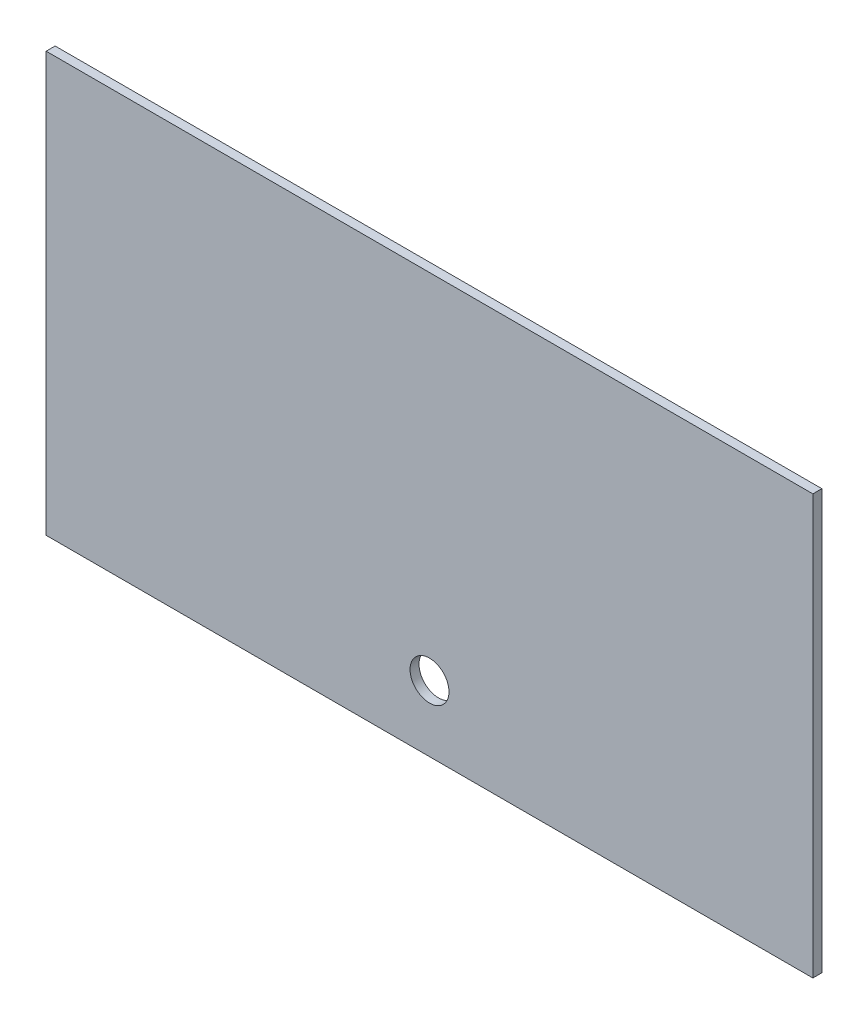
ISO-10303-21;
HEADER;
FILE_DESCRIPTION(('STEP AP214'),'2;1');
FILE_NAME('part.step','',(''),(''),'','','');
FILE_SCHEMA(('AUTOMOTIVE_DESIGN { 1 0 10303 214 1 1 1 1 }'));
ENDSEC;
DATA;
#1=APPLICATION_CONTEXT('core data for automotive mechanical design processes');
#2=APPLICATION_PROTOCOL_DEFINITION('international standard','automotive_design',2000,#1);
#3=PRODUCT_CONTEXT('',#1,'mechanical');
#4=PRODUCT('Part','Part','',(#3));
#5=PRODUCT_RELATED_PRODUCT_CATEGORY('part','',(#4));
#6=PRODUCT_DEFINITION_FORMATION('','',#4);
#7=PRODUCT_DEFINITION_CONTEXT('part definition',#1,'design');
#8=PRODUCT_DEFINITION('design','',#6,#7);
#9=PRODUCT_DEFINITION_SHAPE('','',#8);
#10=(LENGTH_UNIT() NAMED_UNIT(*) SI_UNIT(.MILLI.,.METRE.));
#11=(NAMED_UNIT(*) PLANE_ANGLE_UNIT() SI_UNIT($,.RADIAN.));
#12=(NAMED_UNIT(*) SI_UNIT($,.STERADIAN.) SOLID_ANGLE_UNIT());
#13=UNCERTAINTY_MEASURE_WITH_UNIT(LENGTH_MEASURE(1.E-05),#10,'distance_accuracy_value','');
#14=(GEOMETRIC_REPRESENTATION_CONTEXT(3) GLOBAL_UNCERTAINTY_ASSIGNED_CONTEXT((#13)) GLOBAL_UNIT_ASSIGNED_CONTEXT((#10,
#11,#12)) REPRESENTATION_CONTEXT('',''));
#15=CARTESIAN_POINT('',(0.,0.,0.));
#16=DIRECTION('',(0.,0.,1.));
#17=DIRECTION('',(1.,0.,0.));
#18=AXIS2_PLACEMENT_3D('',#15,#16,#17);
#19=CARTESIAN_POINT('',(64.,-35.,1.5));
#20=DIRECTION('',(-1.,0.,0.));
#21=DIRECTION('',(0.,0.,1.));
#22=AXIS2_PLACEMENT_3D('',#19,#20,#21);
#23=PLANE('',#22);
#24=DIRECTION('',(0.,1.,0.));
#25=VECTOR('',#24,1.);
#26=CARTESIAN_POINT('',(64.,-35.,0.));
#27=LINE('',#26,#25);
#28=CARTESIAN_POINT('',(64.,-35.,0.));
#29=VERTEX_POINT('',#28);
#30=CARTESIAN_POINT('',(64.,35.,0.));
#31=VERTEX_POINT('',#30);
#32=EDGE_CURVE('E107',#29,#31,#27,.T.);
#33=ORIENTED_EDGE('',*,*,#32,.T.);
#34=DIRECTION('',(0.,0.,-1.));
#35=VECTOR('',#34,1.);
#36=CARTESIAN_POINT('',(64.,35.,1.5));
#37=LINE('',#36,#35);
#38=CARTESIAN_POINT('',(64.,35.,1.5));
#39=VERTEX_POINT('',#38);
#40=EDGE_CURVE('E11',#39,#31,#37,.T.);
#41=ORIENTED_EDGE('',*,*,#40,.F.);
#42=DIRECTION('',(0.,1.,0.));
#43=VECTOR('',#42,1.);
#44=CARTESIAN_POINT('',(64.,-35.,1.5));
#45=LINE('',#44,#43);
#46=CARTESIAN_POINT('',(64.,-35.,1.5));
#47=VERTEX_POINT('',#46);
#48=EDGE_CURVE('E91',#47,#39,#45,.T.);
#49=ORIENTED_EDGE('',*,*,#48,.F.);
#50=DIRECTION('',(0.,0.,-1.));
#51=VECTOR('',#50,1.);
#52=CARTESIAN_POINT('',(64.,-35.,1.5));
#53=LINE('',#52,#51);
#54=EDGE_CURVE('E103',#47,#29,#53,.T.);
#55=ORIENTED_EDGE('',*,*,#54,.T.);
#56=EDGE_LOOP('',(#33,#41,#49,#55));
#57=FACE_BOUND('',#56,.T.);
#58=ADVANCED_FACE('F39',(#57),#23,.F.);
#59=CARTESIAN_POINT('',(-64.,35.,1.5));
#60=DIRECTION('',(0.,-1.,0.));
#61=DIRECTION('',(0.,0.,-1.));
#62=AXIS2_PLACEMENT_3D('',#59,#60,#61);
#63=PLANE('',#62);
#64=DIRECTION('',(-1.,0.,0.));
#65=VECTOR('',#64,1.);
#66=CARTESIAN_POINT('',(-64.,35.,0.));
#67=LINE('',#66,#65);
#68=CARTESIAN_POINT('',(-64.,35.,0.));
#69=VERTEX_POINT('',#68);
#70=EDGE_CURVE('E96',#31,#69,#67,.T.);
#71=ORIENTED_EDGE('',*,*,#70,.T.);
#72=DIRECTION('',(0.,0.,-1.));
#73=VECTOR('',#72,1.);
#74=CARTESIAN_POINT('',(-64.,35.,1.5));
#75=LINE('',#74,#73);
#76=CARTESIAN_POINT('',(-64.,35.,1.5));
#77=VERTEX_POINT('',#76);
#78=EDGE_CURVE('E48',#77,#69,#75,.T.);
#79=ORIENTED_EDGE('',*,*,#78,.F.);
#80=DIRECTION('',(-1.,0.,0.));
#81=VECTOR('',#80,1.);
#82=CARTESIAN_POINT('',(-64.,35.,1.5));
#83=LINE('',#82,#81);
#84=EDGE_CURVE('E86',#39,#77,#83,.T.);
#85=ORIENTED_EDGE('',*,*,#84,.F.);
#86=ORIENTED_EDGE('',*,*,#40,.T.);
#87=EDGE_LOOP('',(#71,#79,#85,#86));
#88=FACE_BOUND('',#87,.T.);
#89=ADVANCED_FACE('F95',(#88),#63,.F.);
#90=CARTESIAN_POINT('',(-64.,-35.,1.5));
#91=DIRECTION('',(1.,0.,0.));
#92=DIRECTION('',(0.,0.,-1.));
#93=AXIS2_PLACEMENT_3D('',#90,#91,#92);
#94=PLANE('',#93);
#95=DIRECTION('',(0.,-1.,0.));
#96=VECTOR('',#95,1.);
#97=CARTESIAN_POINT('',(-64.,-35.,0.));
#98=LINE('',#97,#96);
#99=CARTESIAN_POINT('',(-64.,-35.,0.));
#100=VERTEX_POINT('',#99);
#101=EDGE_CURVE('E73',#69,#100,#98,.T.);
#102=ORIENTED_EDGE('',*,*,#101,.T.);
#103=DIRECTION('',(0.,0.,-1.));
#104=VECTOR('',#103,1.);
#105=CARTESIAN_POINT('',(-64.,-35.,1.5));
#106=LINE('',#105,#104);
#107=CARTESIAN_POINT('',(-64.,-35.,1.5));
#108=VERTEX_POINT('',#107);
#109=EDGE_CURVE('E98',#108,#100,#106,.T.);
#110=ORIENTED_EDGE('',*,*,#109,.F.);
#111=DIRECTION('',(0.,-1.,0.));
#112=VECTOR('',#111,1.);
#113=CARTESIAN_POINT('',(-64.,-35.,1.5));
#114=LINE('',#113,#112);
#115=EDGE_CURVE('E89',#77,#108,#114,.T.);
#116=ORIENTED_EDGE('',*,*,#115,.F.);
#117=ORIENTED_EDGE('',*,*,#78,.T.);
#118=EDGE_LOOP('',(#102,#110,#116,#117));
#119=FACE_BOUND('',#118,.T.);
#120=ADVANCED_FACE('F99',(#119),#94,.F.);
#121=CARTESIAN_POINT('',(-64.,-35.,1.5));
#122=DIRECTION('',(0.,1.,0.));
#123=DIRECTION('',(0.,0.,1.));
#124=AXIS2_PLACEMENT_3D('',#121,#122,#123);
#125=PLANE('',#124);
#126=DIRECTION('',(1.,0.,0.));
#127=VECTOR('',#126,1.);
#128=CARTESIAN_POINT('',(-64.,-35.,0.));
#129=LINE('',#128,#127);
#130=EDGE_CURVE('E79',#100,#29,#129,.T.);
#131=ORIENTED_EDGE('',*,*,#130,.T.);
#132=ORIENTED_EDGE('',*,*,#54,.F.);
#133=DIRECTION('',(1.,0.,0.));
#134=VECTOR('',#133,1.);
#135=CARTESIAN_POINT('',(-64.,-35.,1.5));
#136=LINE('',#135,#134);
#137=EDGE_CURVE('E56',#108,#47,#136,.T.);
#138=ORIENTED_EDGE('',*,*,#137,.F.);
#139=ORIENTED_EDGE('',*,*,#109,.T.);
#140=EDGE_LOOP('',(#131,#132,#138,#139));
#141=FACE_BOUND('',#140,.T.);
#142=ADVANCED_FACE('F121',(#141),#125,.F.);
#143=CARTESIAN_POINT('',(0.,0.,1.5));
#144=DIRECTION('',(0.,0.,-1.));
#145=DIRECTION('',(-1.,0.,0.));
#146=AXIS2_PLACEMENT_3D('',#143,#144,#145);
#147=PLANE('',#146);
#148=CARTESIAN_POINT('',(0.,-24.,1.5));
#149=DIRECTION('',(0.,0.,-1.));
#150=DIRECTION('',(-1.,0.,0.));
#151=AXIS2_PLACEMENT_3D('',#148,#149,#150);
#152=CIRCLE('',#151,3.25);
#153=CARTESIAN_POINT('',(-3.25,-24.,1.5));
#154=VERTEX_POINT('',#153);
#155=EDGE_CURVE('E111',#154,#154,#152,.T.);
#156=ORIENTED_EDGE('',*,*,#155,.T.);
#157=EDGE_LOOP('',(#156));
#158=FACE_BOUND('',#157,.T.);
#159=ORIENTED_EDGE('',*,*,#48,.T.);
#160=ORIENTED_EDGE('',*,*,#84,.T.);
#161=ORIENTED_EDGE('',*,*,#115,.T.);
#162=ORIENTED_EDGE('',*,*,#137,.T.);
#163=EDGE_LOOP('',(#159,#160,#161,#162));
#164=FACE_BOUND('',#163,.T.);
#165=ADVANCED_FACE('F87',(#158,#164),#147,.F.);
#166=CARTESIAN_POINT('',(0.,0.,0.));
#167=DIRECTION('',(0.,0.,-1.));
#168=DIRECTION('',(-1.,0.,0.));
#169=AXIS2_PLACEMENT_3D('',#166,#167,#168);
#170=PLANE('',#169);
#171=CARTESIAN_POINT('',(0.,-24.,0.));
#172=DIRECTION('',(0.,0.,-1.));
#173=DIRECTION('',(-1.,0.,0.));
#174=AXIS2_PLACEMENT_3D('',#171,#172,#173);
#175=CIRCLE('',#174,3.25);
#176=CARTESIAN_POINT('',(-3.25,-24.,0.));
#177=VERTEX_POINT('',#176);
#178=EDGE_CURVE('E128',#177,#177,#175,.T.);
#179=ORIENTED_EDGE('',*,*,#178,.F.);
#180=EDGE_LOOP('',(#179));
#181=FACE_BOUND('',#180,.T.);
#182=ORIENTED_EDGE('',*,*,#32,.F.);
#183=ORIENTED_EDGE('',*,*,#130,.F.);
#184=ORIENTED_EDGE('',*,*,#101,.F.);
#185=ORIENTED_EDGE('',*,*,#70,.F.);
#186=EDGE_LOOP('',(#182,#183,#184,#185));
#187=FACE_BOUND('',#186,.T.);
#188=ADVANCED_FACE('F124',(#181,#187),#170,.T.);
#189=CARTESIAN_POINT('',(0.,-24.,1.5));
#190=DIRECTION('',(0.,0.,-1.));
#191=DIRECTION('',(-1.,0.,0.));
#192=AXIS2_PLACEMENT_3D('',#189,#190,#191);
#193=CYLINDRICAL_SURFACE('',#192,3.25);
#194=ORIENTED_EDGE('',*,*,#155,.F.);
#195=EDGE_LOOP('',(#194));
#196=FACE_BOUND('',#195,.T.);
#197=ORIENTED_EDGE('',*,*,#178,.T.);
#198=EDGE_LOOP('',(#197));
#199=FACE_BOUND('',#198,.T.);
#200=ADVANCED_FACE('F137',(#196,#199),#193,.F.);
#201=CLOSED_SHELL('',(#58,#89,#120,#142,#165,#188,#200));
#202=MANIFOLD_SOLID_BREP('B2',#201);
#203=ADVANCED_BREP_SHAPE_REPRESENTATION('',(#18,#202),#14);
#204=SHAPE_DEFINITION_REPRESENTATION(#9,#203);
ENDSEC;
END-ISO-10303-21;
